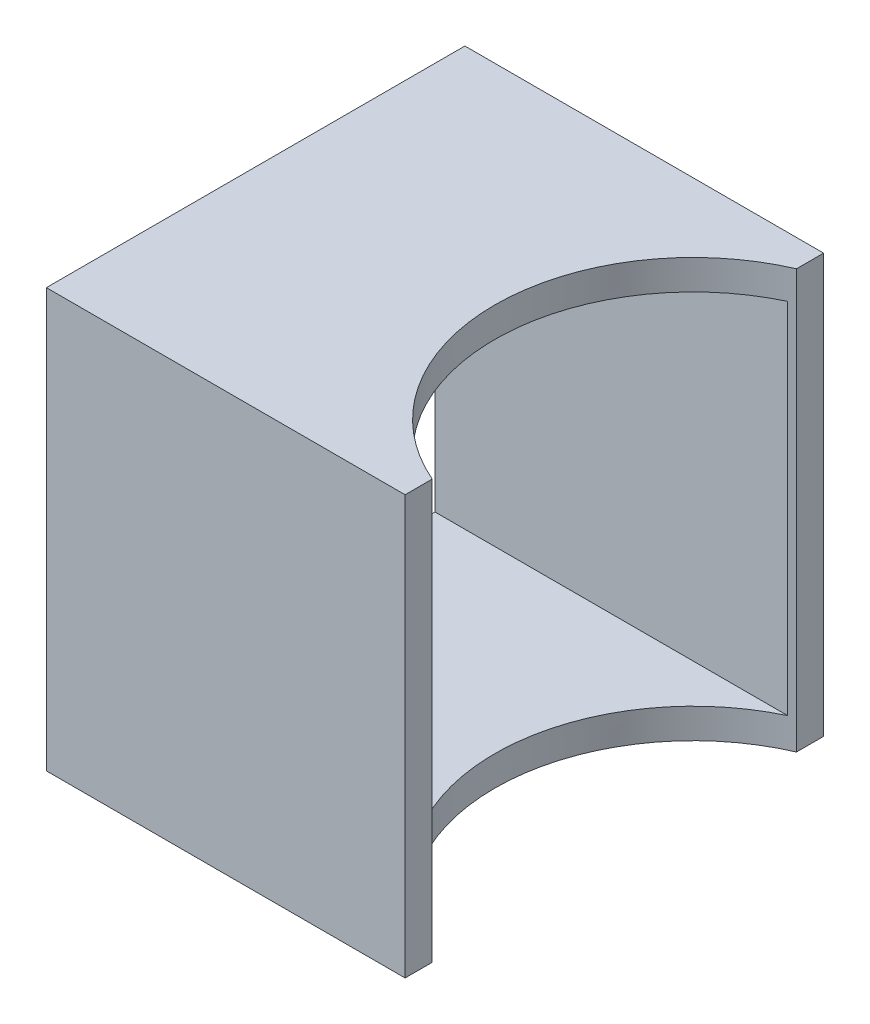
ISO-10303-21;
HEADER;
FILE_DESCRIPTION(('STEP AP214'),'2;1');
FILE_NAME('part.step','',(''),(''),'','','');
FILE_SCHEMA(('AUTOMOTIVE_DESIGN { 1 0 10303 214 1 1 1 1 }'));
ENDSEC;
DATA;
#1=APPLICATION_CONTEXT('core data for automotive mechanical design processes');
#2=APPLICATION_PROTOCOL_DEFINITION('international standard','automotive_design',2000,#1);
#3=PRODUCT_CONTEXT('',#1,'mechanical');
#4=PRODUCT('Part','Part','',(#3));
#5=PRODUCT_RELATED_PRODUCT_CATEGORY('part','',(#4));
#6=PRODUCT_DEFINITION_FORMATION('','',#4);
#7=PRODUCT_DEFINITION_CONTEXT('part definition',#1,'design');
#8=PRODUCT_DEFINITION('design','',#6,#7);
#9=PRODUCT_DEFINITION_SHAPE('','',#8);
#10=(LENGTH_UNIT() NAMED_UNIT(*) SI_UNIT(.MILLI.,.METRE.));
#11=(NAMED_UNIT(*) PLANE_ANGLE_UNIT() SI_UNIT($,.RADIAN.));
#12=(NAMED_UNIT(*) SI_UNIT($,.STERADIAN.) SOLID_ANGLE_UNIT());
#13=UNCERTAINTY_MEASURE_WITH_UNIT(LENGTH_MEASURE(1.E-05),#10,'distance_accuracy_value','');
#14=(GEOMETRIC_REPRESENTATION_CONTEXT(3) GLOBAL_UNCERTAINTY_ASSIGNED_CONTEXT((#13)) GLOBAL_UNIT_ASSIGNED_CONTEXT((#10,
#11,#12)) REPRESENTATION_CONTEXT('',''));
#15=CARTESIAN_POINT('',(0.,0.,0.));
#16=DIRECTION('',(0.,0.,1.));
#17=DIRECTION('',(1.,0.,0.));
#18=AXIS2_PLACEMENT_3D('',#15,#16,#17);
#19=CARTESIAN_POINT('',(46.482,44.45,0.));
#20=DIRECTION('',(0.,-1.,0.));
#21=DIRECTION('',(0.,0.,-1.));
#22=AXIS2_PLACEMENT_3D('',#19,#20,#21);
#23=CYLINDRICAL_SURFACE('',#22,21.082);
#24=CARTESIAN_POINT('',(46.482,41.275,0.));
#25=DIRECTION('',(0.,1.,0.));
#26=DIRECTION('',(0.,0.,1.));
#27=AXIS2_PLACEMENT_3D('',#24,#25,#26);
#28=CIRCLE('',#27,21.082);
#29=CARTESIAN_POINT('',(37.4515944720073,41.275,-19.05));
#30=VERTEX_POINT('',#29);
#31=CARTESIAN_POINT('',(37.4515944720073,41.275,19.05));
#32=VERTEX_POINT('',#31);
#33=EDGE_CURVE('E142',#30,#32,#28,.T.);
#34=ORIENTED_EDGE('',*,*,#33,.F.);
#35=DIRECTION('',(0.,-1.,0.));
#36=VECTOR('',#35,1.);
#37=CARTESIAN_POINT('',(37.4515944720073,44.45,-19.05));
#38=LINE('',#37,#36);
#39=CARTESIAN_POINT('',(37.4515944720073,3.175,-19.05));
#40=VERTEX_POINT('',#39);
#41=EDGE_CURVE('E135',#40,#30,#38,.F.);
#42=ORIENTED_EDGE('',*,*,#41,.F.);
#43=CARTESIAN_POINT('',(46.482,3.175,0.));
#44=DIRECTION('',(0.,-1.,0.));
#45=DIRECTION('',(0.,0.,-1.));
#46=AXIS2_PLACEMENT_3D('',#43,#44,#45);
#47=CIRCLE('',#46,21.082);
#48=CARTESIAN_POINT('',(37.4515944720073,3.175,19.05));
#49=VERTEX_POINT('',#48);
#50=EDGE_CURVE('E115',#49,#40,#47,.T.);
#51=ORIENTED_EDGE('',*,*,#50,.F.);
#52=DIRECTION('',(0.,-1.,0.));
#53=VECTOR('',#52,1.);
#54=CARTESIAN_POINT('',(37.4515944720073,44.45,19.05));
#55=LINE('',#54,#53);
#56=EDGE_CURVE('E140',#32,#49,#55,.T.);
#57=ORIENTED_EDGE('',*,*,#56,.F.);
#58=EDGE_LOOP('',(#34,#42,#51,#57));
#59=FACE_BOUND('',#58,.T.);
#60=CARTESIAN_POINT('',(46.482,0.,0.));
#61=DIRECTION('',(0.,1.,0.));
#62=DIRECTION('',(0.,0.,1.));
#63=AXIS2_PLACEMENT_3D('',#60,#61,#62);
#64=CIRCLE('',#63,21.082);
#65=CARTESIAN_POINT('',(38.1,0.,-19.3440636888943));
#66=VERTEX_POINT('',#65);
#67=CARTESIAN_POINT('',(38.1,0.,19.3440636888943));
#68=VERTEX_POINT('',#67);
#69=EDGE_CURVE('E144',#66,#68,#64,.T.);
#70=ORIENTED_EDGE('',*,*,#69,.F.);
#71=DIRECTION('',(0.,-1.,0.));
#72=VECTOR('',#71,1.);
#73=CARTESIAN_POINT('',(38.1,44.45,-19.3440636888943));
#74=LINE('',#73,#72);
#75=CARTESIAN_POINT('',(38.1,44.45,-19.3440636888943));
#76=VERTEX_POINT('',#75);
#77=EDGE_CURVE('E11',#76,#66,#74,.T.);
#78=ORIENTED_EDGE('',*,*,#77,.F.);
#79=CARTESIAN_POINT('',(46.482,44.45,0.));
#80=DIRECTION('',(0.,1.,0.));
#81=DIRECTION('',(0.,0.,1.));
#82=AXIS2_PLACEMENT_3D('',#79,#80,#81);
#83=CIRCLE('',#82,21.082);
#84=CARTESIAN_POINT('',(38.1,44.45,19.3440636888943));
#85=VERTEX_POINT('',#84);
#86=EDGE_CURVE('E145',#76,#85,#83,.T.);
#87=ORIENTED_EDGE('',*,*,#86,.T.);
#88=DIRECTION('',(0.,-1.,0.));
#89=VECTOR('',#88,1.);
#90=CARTESIAN_POINT('',(38.1,44.45,19.3440636888943));
#91=LINE('',#90,#89);
#92=EDGE_CURVE('E162',#85,#68,#91,.T.);
#93=ORIENTED_EDGE('',*,*,#92,.T.);
#94=EDGE_LOOP('',(#70,#78,#87,#93));
#95=FACE_BOUND('',#94,.T.);
#96=ADVANCED_FACE('F34',(#59,#95),#23,.F.);
#97=CARTESIAN_POINT('',(38.1000000000001,44.45,0.));
#98=DIRECTION('',(1.,0.,0.));
#99=DIRECTION('',(0.,0.,-1.));
#100=AXIS2_PLACEMENT_3D('',#97,#98,#99);
#101=PLANE('',#100);
#102=DIRECTION('',(0.,0.,1.));
#103=VECTOR('',#102,1.);
#104=CARTESIAN_POINT('',(38.1000000000001,0.,0.));
#105=LINE('',#104,#103);
#106=CARTESIAN_POINT('',(38.1,0.,-22.225));
#107=VERTEX_POINT('',#106);
#108=EDGE_CURVE('E165',#107,#66,#105,.T.);
#109=ORIENTED_EDGE('',*,*,#108,.F.);
#110=DIRECTION('',(0.,-1.,0.));
#111=VECTOR('',#110,1.);
#112=CARTESIAN_POINT('',(38.1,44.45,-22.225));
#113=LINE('',#112,#111);
#114=CARTESIAN_POINT('',(38.1,44.45,-22.225));
#115=VERTEX_POINT('',#114);
#116=EDGE_CURVE('E41',#115,#107,#113,.T.);
#117=ORIENTED_EDGE('',*,*,#116,.F.);
#118=DIRECTION('',(0.,0.,1.));
#119=VECTOR('',#118,1.);
#120=CARTESIAN_POINT('',(38.1000000000001,44.45,0.));
#121=LINE('',#120,#119);
#122=EDGE_CURVE('E148',#115,#76,#121,.T.);
#123=ORIENTED_EDGE('',*,*,#122,.T.);
#124=ORIENTED_EDGE('',*,*,#77,.T.);
#125=EDGE_LOOP('',(#109,#117,#123,#124));
#126=FACE_BOUND('',#125,.T.);
#127=ADVANCED_FACE('F192',(#126),#101,.T.);
#128=CARTESIAN_POINT('',(0.,44.45,-22.225));
#129=DIRECTION('',(0.,0.,-1.));
#130=DIRECTION('',(-1.,0.,0.));
#131=AXIS2_PLACEMENT_3D('',#128,#129,#130);
#132=PLANE('',#131);
#133=DIRECTION('',(1.,0.,0.));
#134=VECTOR('',#133,1.);
#135=CARTESIAN_POINT('',(0.,0.,-22.225));
#136=LINE('',#135,#134);
#137=CARTESIAN_POINT('',(0.,0.,-22.225));
#138=VERTEX_POINT('',#137);
#139=EDGE_CURVE('E168',#138,#107,#136,.T.);
#140=ORIENTED_EDGE('',*,*,#139,.F.);
#141=DIRECTION('',(0.,-1.,0.));
#142=VECTOR('',#141,1.);
#143=CARTESIAN_POINT('',(0.,44.45,-22.225));
#144=LINE('',#143,#142);
#145=CARTESIAN_POINT('',(0.,44.45,-22.225));
#146=VERTEX_POINT('',#145);
#147=EDGE_CURVE('E184',#146,#138,#144,.T.);
#148=ORIENTED_EDGE('',*,*,#147,.F.);
#149=DIRECTION('',(1.,0.,0.));
#150=VECTOR('',#149,1.);
#151=CARTESIAN_POINT('',(0.,44.45,-22.225));
#152=LINE('',#151,#150);
#153=EDGE_CURVE('E152',#146,#115,#152,.T.);
#154=ORIENTED_EDGE('',*,*,#153,.T.);
#155=ORIENTED_EDGE('',*,*,#116,.T.);
#156=EDGE_LOOP('',(#140,#148,#154,#155));
#157=FACE_BOUND('',#156,.T.);
#158=ADVANCED_FACE('F188',(#157),#132,.T.);
#159=CARTESIAN_POINT('',(0.,44.45,0.));
#160=DIRECTION('',(-1.,0.,0.));
#161=DIRECTION('',(0.,0.,1.));
#162=AXIS2_PLACEMENT_3D('',#159,#160,#161);
#163=PLANE('',#162);
#164=DIRECTION('',(0.,0.,-1.));
#165=VECTOR('',#164,1.);
#166=CARTESIAN_POINT('',(0.,41.275,-19.05));
#167=LINE('',#166,#165);
#168=CARTESIAN_POINT('',(0.,41.275,19.05));
#169=VERTEX_POINT('',#168);
#170=CARTESIAN_POINT('',(0.,41.275,-19.05));
#171=VERTEX_POINT('',#170);
#172=EDGE_CURVE('E56',#169,#171,#167,.T.);
#173=ORIENTED_EDGE('',*,*,#172,.F.);
#174=DIRECTION('',(0.,1.,0.));
#175=VECTOR('',#174,1.);
#176=CARTESIAN_POINT('',(0.,41.275,19.05));
#177=LINE('',#176,#175);
#178=CARTESIAN_POINT('',(0.,3.175,19.05));
#179=VERTEX_POINT('',#178);
#180=EDGE_CURVE('E128',#179,#169,#177,.T.);
#181=ORIENTED_EDGE('',*,*,#180,.F.);
#182=DIRECTION('',(0.,0.,1.));
#183=VECTOR('',#182,1.);
#184=CARTESIAN_POINT('',(0.,3.175,-19.05));
#185=LINE('',#184,#183);
#186=CARTESIAN_POINT('',(0.,3.175,-19.05));
#187=VERTEX_POINT('',#186);
#188=EDGE_CURVE('E112',#187,#179,#185,.T.);
#189=ORIENTED_EDGE('',*,*,#188,.F.);
#190=DIRECTION('',(0.,-1.,0.));
#191=VECTOR('',#190,1.);
#192=CARTESIAN_POINT('',(0.,41.275,-19.05));
#193=LINE('',#192,#191);
#194=EDGE_CURVE('E121',#171,#187,#193,.T.);
#195=ORIENTED_EDGE('',*,*,#194,.F.);
#196=EDGE_LOOP('',(#173,#181,#189,#195));
#197=FACE_BOUND('',#196,.T.);
#198=DIRECTION('',(0.,0.,-1.));
#199=VECTOR('',#198,1.);
#200=CARTESIAN_POINT('',(0.,0.,0.));
#201=LINE('',#200,#199);
#202=CARTESIAN_POINT('',(0.,0.,22.225));
#203=VERTEX_POINT('',#202);
#204=EDGE_CURVE('E171',#203,#138,#201,.T.);
#205=ORIENTED_EDGE('',*,*,#204,.F.);
#206=DIRECTION('',(0.,-1.,0.));
#207=VECTOR('',#206,1.);
#208=CARTESIAN_POINT('',(0.,44.45,22.225));
#209=LINE('',#208,#207);
#210=CARTESIAN_POINT('',(0.,44.45,22.225));
#211=VERTEX_POINT('',#210);
#212=EDGE_CURVE('E182',#211,#203,#209,.T.);
#213=ORIENTED_EDGE('',*,*,#212,.F.);
#214=DIRECTION('',(0.,0.,-1.));
#215=VECTOR('',#214,1.);
#216=CARTESIAN_POINT('',(0.,44.45,0.));
#217=LINE('',#216,#215);
#218=EDGE_CURVE('E155',#211,#146,#217,.T.);
#219=ORIENTED_EDGE('',*,*,#218,.T.);
#220=ORIENTED_EDGE('',*,*,#147,.T.);
#221=EDGE_LOOP('',(#205,#213,#219,#220));
#222=FACE_BOUND('',#221,.T.);
#223=ADVANCED_FACE('F125',(#197,#222),#163,.T.);
#224=CARTESIAN_POINT('',(0.,44.45,22.225));
#225=DIRECTION('',(0.,0.,-1.));
#226=DIRECTION('',(-1.,0.,0.));
#227=AXIS2_PLACEMENT_3D('',#224,#225,#226);
#228=PLANE('',#227);
#229=DIRECTION('',(1.,0.,0.));
#230=VECTOR('',#229,1.);
#231=CARTESIAN_POINT('',(0.,0.,22.225));
#232=LINE('',#231,#230);
#233=CARTESIAN_POINT('',(38.1,0.,22.225));
#234=VERTEX_POINT('',#233);
#235=EDGE_CURVE('E174',#203,#234,#232,.T.);
#236=ORIENTED_EDGE('',*,*,#235,.T.);
#237=DIRECTION('',(0.,-1.,0.));
#238=VECTOR('',#237,1.);
#239=CARTESIAN_POINT('',(38.1,44.45,22.225));
#240=LINE('',#239,#238);
#241=CARTESIAN_POINT('',(38.1,44.45,22.225));
#242=VERTEX_POINT('',#241);
#243=EDGE_CURVE('E179',#242,#234,#240,.T.);
#244=ORIENTED_EDGE('',*,*,#243,.F.);
#245=DIRECTION('',(1.,0.,0.));
#246=VECTOR('',#245,1.);
#247=CARTESIAN_POINT('',(0.,44.45,22.225));
#248=LINE('',#247,#246);
#249=EDGE_CURVE('E158',#211,#242,#248,.T.);
#250=ORIENTED_EDGE('',*,*,#249,.F.);
#251=ORIENTED_EDGE('',*,*,#212,.T.);
#252=EDGE_LOOP('',(#236,#244,#250,#251));
#253=FACE_BOUND('',#252,.T.);
#254=ADVANCED_FACE('F211',(#253),#228,.F.);
#255=CARTESIAN_POINT('',(38.1000000000001,44.45,0.));
#256=DIRECTION('',(-1.,0.,0.));
#257=DIRECTION('',(0.,0.,1.));
#258=AXIS2_PLACEMENT_3D('',#255,#256,#257);
#259=PLANE('',#258);
#260=DIRECTION('',(0.,0.,-1.));
#261=VECTOR('',#260,1.);
#262=CARTESIAN_POINT('',(38.1000000000001,0.,0.));
#263=LINE('',#262,#261);
#264=EDGE_CURVE('E149',#234,#68,#263,.T.);
#265=ORIENTED_EDGE('',*,*,#264,.T.);
#266=ORIENTED_EDGE('',*,*,#92,.F.);
#267=DIRECTION('',(0.,0.,-1.));
#268=VECTOR('',#267,1.);
#269=CARTESIAN_POINT('',(38.1000000000001,44.45,0.));
#270=LINE('',#269,#268);
#271=EDGE_CURVE('E160',#242,#85,#270,.T.);
#272=ORIENTED_EDGE('',*,*,#271,.F.);
#273=ORIENTED_EDGE('',*,*,#243,.T.);
#274=EDGE_LOOP('',(#265,#266,#272,#273));
#275=FACE_BOUND('',#274,.T.);
#276=ADVANCED_FACE('F208',(#275),#259,.F.);
#277=CARTESIAN_POINT('',(0.,44.45,0.));
#278=DIRECTION('',(0.,1.,0.));
#279=DIRECTION('',(0.,0.,1.));
#280=AXIS2_PLACEMENT_3D('',#277,#278,#279);
#281=PLANE('',#280);
#282=ORIENTED_EDGE('',*,*,#86,.F.);
#283=ORIENTED_EDGE('',*,*,#122,.F.);
#284=ORIENTED_EDGE('',*,*,#153,.F.);
#285=ORIENTED_EDGE('',*,*,#218,.F.);
#286=ORIENTED_EDGE('',*,*,#249,.T.);
#287=ORIENTED_EDGE('',*,*,#271,.T.);
#288=EDGE_LOOP('',(#282,#283,#284,#285,#286,#287));
#289=FACE_BOUND('',#288,.T.);
#290=ADVANCED_FACE('F203',(#289),#281,.T.);
#291=CARTESIAN_POINT('',(0.,0.,0.));
#292=DIRECTION('',(0.,1.,0.));
#293=DIRECTION('',(0.,0.,1.));
#294=AXIS2_PLACEMENT_3D('',#291,#292,#293);
#295=PLANE('',#294);
#296=ORIENTED_EDGE('',*,*,#69,.T.);
#297=ORIENTED_EDGE('',*,*,#264,.F.);
#298=ORIENTED_EDGE('',*,*,#235,.F.);
#299=ORIENTED_EDGE('',*,*,#204,.T.);
#300=ORIENTED_EDGE('',*,*,#139,.T.);
#301=ORIENTED_EDGE('',*,*,#108,.T.);
#302=EDGE_LOOP('',(#296,#297,#298,#299,#300,#301));
#303=FACE_BOUND('',#302,.T.);
#304=ADVANCED_FACE('F195',(#303),#295,.F.);
#305=CARTESIAN_POINT('',(38.1,41.275,-19.05));
#306=DIRECTION('',(0.,1.,0.));
#307=DIRECTION('',(0.,0.,1.));
#308=AXIS2_PLACEMENT_3D('',#305,#306,#307);
#309=PLANE('',#308);
#310=ORIENTED_EDGE('',*,*,#33,.T.);
#311=DIRECTION('',(-1.,0.,0.));
#312=VECTOR('',#311,1.);
#313=CARTESIAN_POINT('',(38.1,41.275,19.05));
#314=LINE('',#313,#312);
#315=EDGE_CURVE('E133',#32,#169,#314,.T.);
#316=ORIENTED_EDGE('',*,*,#315,.T.);
#317=ORIENTED_EDGE('',*,*,#172,.T.);
#318=DIRECTION('',(-1.,0.,0.));
#319=VECTOR('',#318,1.);
#320=CARTESIAN_POINT('',(38.1,41.275,-19.05));
#321=LINE('',#320,#319);
#322=EDGE_CURVE('E118',#30,#171,#321,.T.);
#323=ORIENTED_EDGE('',*,*,#322,.F.);
#324=EDGE_LOOP('',(#310,#316,#317,#323));
#325=FACE_BOUND('',#324,.T.);
#326=ADVANCED_FACE('F228',(#325),#309,.F.);
#327=CARTESIAN_POINT('',(38.1,41.275,19.05));
#328=DIRECTION('',(0.,0.,1.));
#329=DIRECTION('',(0.,-1.,0.));
#330=AXIS2_PLACEMENT_3D('',#327,#328,#329);
#331=PLANE('',#330);
#332=ORIENTED_EDGE('',*,*,#56,.T.);
#333=DIRECTION('',(-1.,0.,0.));
#334=VECTOR('',#333,1.);
#335=CARTESIAN_POINT('',(38.1,3.175,19.05));
#336=LINE('',#335,#334);
#337=EDGE_CURVE('E117',#49,#179,#336,.T.);
#338=ORIENTED_EDGE('',*,*,#337,.T.);
#339=ORIENTED_EDGE('',*,*,#180,.T.);
#340=ORIENTED_EDGE('',*,*,#315,.F.);
#341=EDGE_LOOP('',(#332,#338,#339,#340));
#342=FACE_BOUND('',#341,.T.);
#343=ADVANCED_FACE('F230',(#342),#331,.F.);
#344=CARTESIAN_POINT('',(38.1,3.175,-19.05));
#345=DIRECTION('',(0.,-1.,0.));
#346=DIRECTION('',(0.,0.,-1.));
#347=AXIS2_PLACEMENT_3D('',#344,#345,#346);
#348=PLANE('',#347);
#349=ORIENTED_EDGE('',*,*,#50,.T.);
#350=DIRECTION('',(-1.,0.,0.));
#351=VECTOR('',#350,1.);
#352=CARTESIAN_POINT('',(38.1,3.175,-19.05));
#353=LINE('',#352,#351);
#354=EDGE_CURVE('E48',#40,#187,#353,.T.);
#355=ORIENTED_EDGE('',*,*,#354,.T.);
#356=ORIENTED_EDGE('',*,*,#188,.T.);
#357=ORIENTED_EDGE('',*,*,#337,.F.);
#358=EDGE_LOOP('',(#349,#355,#356,#357));
#359=FACE_BOUND('',#358,.T.);
#360=ADVANCED_FACE('F109',(#359),#348,.F.);
#361=CARTESIAN_POINT('',(38.1,41.275,-19.05));
#362=DIRECTION('',(0.,0.,-1.));
#363=DIRECTION('',(-1.,0.,0.));
#364=AXIS2_PLACEMENT_3D('',#361,#362,#363);
#365=PLANE('',#364);
#366=ORIENTED_EDGE('',*,*,#41,.T.);
#367=ORIENTED_EDGE('',*,*,#322,.T.);
#368=ORIENTED_EDGE('',*,*,#194,.T.);
#369=ORIENTED_EDGE('',*,*,#354,.F.);
#370=EDGE_LOOP('',(#366,#367,#368,#369));
#371=FACE_BOUND('',#370,.T.);
#372=ADVANCED_FACE('F122',(#371),#365,.F.);
#373=CLOSED_SHELL('',(#96,#127,#158,#223,#254,#276,#290,#304,#326,#343,#360,#372));
#374=MANIFOLD_SOLID_BREP('B2',#373);
#375=ADVANCED_BREP_SHAPE_REPRESENTATION('',(#18,#374),#14);
#376=SHAPE_DEFINITION_REPRESENTATION(#9,#375);
ENDSEC;
END-ISO-10303-21;
